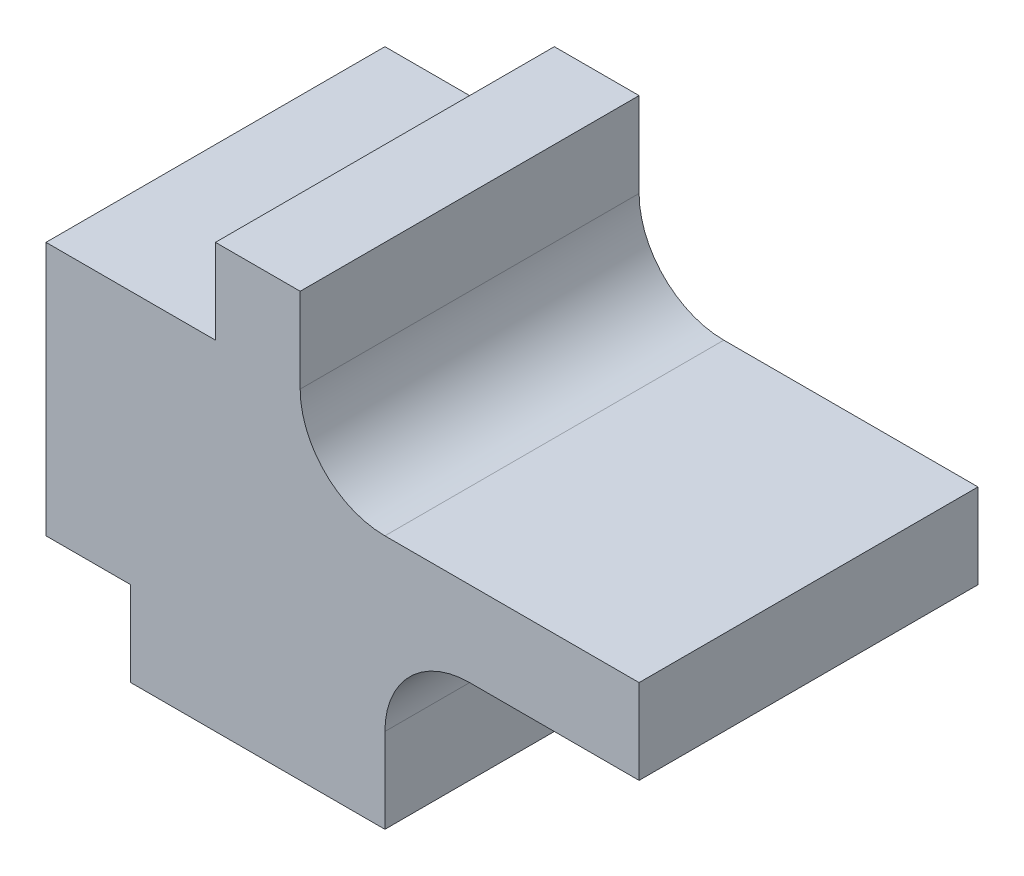
ISO-10303-21;
HEADER;
FILE_DESCRIPTION(('STEP AP214'),'2;1');
FILE_NAME('part.step','',(''),(''),'','','');
FILE_SCHEMA(('AUTOMOTIVE_DESIGN { 1 0 10303 214 1 1 1 1 }'));
ENDSEC;
DATA;
#1=APPLICATION_CONTEXT('core data for automotive mechanical design processes');
#2=APPLICATION_PROTOCOL_DEFINITION('international standard','automotive_design',2000,#1);
#3=PRODUCT_CONTEXT('',#1,'mechanical');
#4=PRODUCT('Part','Part','',(#3));
#5=PRODUCT_RELATED_PRODUCT_CATEGORY('part','',(#4));
#6=PRODUCT_DEFINITION_FORMATION('','',#4);
#7=PRODUCT_DEFINITION_CONTEXT('part definition',#1,'design');
#8=PRODUCT_DEFINITION('design','',#6,#7);
#9=PRODUCT_DEFINITION_SHAPE('','',#8);
#10=(LENGTH_UNIT() NAMED_UNIT(*) SI_UNIT(.MILLI.,.METRE.));
#11=(NAMED_UNIT(*) PLANE_ANGLE_UNIT() SI_UNIT($,.RADIAN.));
#12=(NAMED_UNIT(*) SI_UNIT($,.STERADIAN.) SOLID_ANGLE_UNIT());
#13=UNCERTAINTY_MEASURE_WITH_UNIT(LENGTH_MEASURE(1.E-05),#10,'distance_accuracy_value','');
#14=(GEOMETRIC_REPRESENTATION_CONTEXT(3) GLOBAL_UNCERTAINTY_ASSIGNED_CONTEXT((#13)) GLOBAL_UNIT_ASSIGNED_CONTEXT((#10,
#11,#12)) REPRESENTATION_CONTEXT('',''));
#15=CARTESIAN_POINT('',(0.,0.,0.));
#16=DIRECTION('',(0.,0.,1.));
#17=DIRECTION('',(1.,0.,0.));
#18=AXIS2_PLACEMENT_3D('',#15,#16,#17);
#19=CARTESIAN_POINT('',(0.,1.,4.));
#20=DIRECTION('',(1.,0.,0.));
#21=DIRECTION('',(0.,1.,0.));
#22=AXIS2_PLACEMENT_3D('',#19,#20,#21);
#23=PLANE('',#22);
#24=DIRECTION('',(0.,-1.,0.));
#25=VECTOR('',#24,1.);
#26=CARTESIAN_POINT('',(0.,1.,0.));
#27=LINE('',#26,#25);
#28=CARTESIAN_POINT('',(0.,1.,0.));
#29=VERTEX_POINT('',#28);
#30=CARTESIAN_POINT('',(0.,0.,0.));
#31=VERTEX_POINT('',#30);
#32=EDGE_CURVE('E165',#29,#31,#27,.T.);
#33=ORIENTED_EDGE('',*,*,#32,.T.);
#34=DIRECTION('',(0.,0.,-1.));
#35=VECTOR('',#34,1.);
#36=CARTESIAN_POINT('',(0.,0.,4.));
#37=LINE('',#36,#35);
#38=CARTESIAN_POINT('',(0.,0.,4.));
#39=VERTEX_POINT('',#38);
#40=EDGE_CURVE('E11',#39,#31,#37,.T.);
#41=ORIENTED_EDGE('',*,*,#40,.F.);
#42=DIRECTION('',(0.,-1.,0.));
#43=VECTOR('',#42,1.);
#44=CARTESIAN_POINT('',(0.,1.,4.));
#45=LINE('',#44,#43);
#46=CARTESIAN_POINT('',(0.,1.,4.));
#47=VERTEX_POINT('',#46);
#48=EDGE_CURVE('E191',#47,#39,#45,.T.);
#49=ORIENTED_EDGE('',*,*,#48,.F.);
#50=DIRECTION('',(0.,0.,-1.));
#51=VECTOR('',#50,1.);
#52=CARTESIAN_POINT('',(0.,1.,4.));
#53=LINE('',#52,#51);
#54=EDGE_CURVE('E161',#47,#29,#53,.T.);
#55=ORIENTED_EDGE('',*,*,#54,.T.);
#56=EDGE_LOOP('',(#33,#41,#49,#55));
#57=FACE_BOUND('',#56,.T.);
#58=ADVANCED_FACE('F33',(#57),#23,.F.);
#59=CARTESIAN_POINT('',(0.,0.,4.));
#60=DIRECTION('',(0.,1.,0.));
#61=DIRECTION('',(0.,0.,1.));
#62=AXIS2_PLACEMENT_3D('',#59,#60,#61);
#63=PLANE('',#62);
#64=DIRECTION('',(1.,0.,0.));
#65=VECTOR('',#64,1.);
#66=CARTESIAN_POINT('',(0.,0.,0.));
#67=LINE('',#66,#65);
#68=CARTESIAN_POINT('',(3.,0.,0.));
#69=VERTEX_POINT('',#68);
#70=EDGE_CURVE('E168',#31,#69,#67,.T.);
#71=ORIENTED_EDGE('',*,*,#70,.T.);
#72=DIRECTION('',(0.,0.,-1.));
#73=VECTOR('',#72,1.);
#74=CARTESIAN_POINT('',(3.,0.,4.));
#75=LINE('',#74,#73);
#76=CARTESIAN_POINT('',(3.,0.,4.));
#77=VERTEX_POINT('',#76);
#78=EDGE_CURVE('E41',#77,#69,#75,.T.);
#79=ORIENTED_EDGE('',*,*,#78,.F.);
#80=DIRECTION('',(1.,0.,0.));
#81=VECTOR('',#80,1.);
#82=CARTESIAN_POINT('',(0.,0.,4.));
#83=LINE('',#82,#81);
#84=EDGE_CURVE('E110',#39,#77,#83,.T.);
#85=ORIENTED_EDGE('',*,*,#84,.F.);
#86=ORIENTED_EDGE('',*,*,#40,.T.);
#87=EDGE_LOOP('',(#71,#79,#85,#86));
#88=FACE_BOUND('',#87,.T.);
#89=ADVANCED_FACE('F279',(#88),#63,.F.);
#90=CARTESIAN_POINT('',(3.,0.,4.));
#91=DIRECTION('',(-1.,0.,0.));
#92=DIRECTION('',(0.,-1.,0.));
#93=AXIS2_PLACEMENT_3D('',#90,#91,#92);
#94=PLANE('',#93);
#95=DIRECTION('',(0.,1.,0.));
#96=VECTOR('',#95,1.);
#97=CARTESIAN_POINT('',(3.,0.,0.));
#98=LINE('',#97,#96);
#99=CARTESIAN_POINT('',(3.,1.,0.));
#100=VERTEX_POINT('',#99);
#101=EDGE_CURVE('E170',#69,#100,#98,.T.);
#102=ORIENTED_EDGE('',*,*,#101,.T.);
#103=DIRECTION('',(0.,0.,-1.));
#104=VECTOR('',#103,1.);
#105=CARTESIAN_POINT('',(3.,1.,4.));
#106=LINE('',#105,#104);
#107=CARTESIAN_POINT('',(3.,1.,4.));
#108=VERTEX_POINT('',#107);
#109=EDGE_CURVE('E216',#108,#100,#106,.T.);
#110=ORIENTED_EDGE('',*,*,#109,.F.);
#111=DIRECTION('',(0.,1.,0.));
#112=VECTOR('',#111,1.);
#113=CARTESIAN_POINT('',(3.,0.,4.));
#114=LINE('',#113,#112);
#115=EDGE_CURVE('E224',#77,#108,#114,.T.);
#116=ORIENTED_EDGE('',*,*,#115,.F.);
#117=ORIENTED_EDGE('',*,*,#78,.T.);
#118=EDGE_LOOP('',(#102,#110,#116,#117));
#119=FACE_BOUND('',#118,.T.);
#120=ADVANCED_FACE('F222',(#119),#94,.F.);
#121=CARTESIAN_POINT('',(4.,1.,4.));
#122=DIRECTION('',(0.,0.,-1.));
#123=DIRECTION('',(-1.,0.,0.));
#124=AXIS2_PLACEMENT_3D('',#121,#122,#123);
#125=CYLINDRICAL_SURFACE('',#124,1.);
#126=CARTESIAN_POINT('',(4.,1.,0.));
#127=DIRECTION('',(0.,0.,-1.));
#128=DIRECTION('',(-1.,0.,0.));
#129=AXIS2_PLACEMENT_3D('',#126,#127,#128);
#130=CIRCLE('',#129,1.);
#131=CARTESIAN_POINT('',(4.,2.,0.));
#132=VERTEX_POINT('',#131);
#133=EDGE_CURVE('E172',#100,#132,#130,.T.);
#134=ORIENTED_EDGE('',*,*,#133,.T.);
#135=DIRECTION('',(0.,0.,-1.));
#136=VECTOR('',#135,1.);
#137=CARTESIAN_POINT('',(4.,2.,4.));
#138=LINE('',#137,#136);
#139=CARTESIAN_POINT('',(4.,2.,4.));
#140=VERTEX_POINT('',#139);
#141=EDGE_CURVE('E213',#140,#132,#138,.T.);
#142=ORIENTED_EDGE('',*,*,#141,.F.);
#143=CARTESIAN_POINT('',(4.,1.,4.));
#144=DIRECTION('',(0.,0.,-1.));
#145=DIRECTION('',(-1.,0.,0.));
#146=AXIS2_PLACEMENT_3D('',#143,#144,#145);
#147=CIRCLE('',#146,1.);
#148=EDGE_CURVE('E242',#108,#140,#147,.T.);
#149=ORIENTED_EDGE('',*,*,#148,.F.);
#150=ORIENTED_EDGE('',*,*,#109,.T.);
#151=EDGE_LOOP('',(#134,#142,#149,#150));
#152=FACE_BOUND('',#151,.T.);
#153=ADVANCED_FACE('F233',(#152),#125,.F.);
#154=CARTESIAN_POINT('',(4.,2.,4.));
#155=DIRECTION('',(0.,1.,0.));
#156=DIRECTION('',(-1.,0.,0.));
#157=AXIS2_PLACEMENT_3D('',#154,#155,#156);
#158=PLANE('',#157);
#159=DIRECTION('',(1.,0.,0.));
#160=VECTOR('',#159,1.);
#161=CARTESIAN_POINT('',(4.,2.,0.));
#162=LINE('',#161,#160);
#163=CARTESIAN_POINT('',(6.,2.,0.));
#164=VERTEX_POINT('',#163);
#165=EDGE_CURVE('E174',#132,#164,#162,.T.);
#166=ORIENTED_EDGE('',*,*,#165,.T.);
#167=DIRECTION('',(0.,0.,-1.));
#168=VECTOR('',#167,1.);
#169=CARTESIAN_POINT('',(6.,2.,4.));
#170=LINE('',#169,#168);
#171=CARTESIAN_POINT('',(6.,2.,4.));
#172=VERTEX_POINT('',#171);
#173=EDGE_CURVE('E210',#172,#164,#170,.T.);
#174=ORIENTED_EDGE('',*,*,#173,.F.);
#175=DIRECTION('',(1.,0.,0.));
#176=VECTOR('',#175,1.);
#177=CARTESIAN_POINT('',(4.,2.,4.));
#178=LINE('',#177,#176);
#179=EDGE_CURVE('E239',#140,#172,#178,.T.);
#180=ORIENTED_EDGE('',*,*,#179,.F.);
#181=ORIENTED_EDGE('',*,*,#141,.T.);
#182=EDGE_LOOP('',(#166,#174,#180,#181));
#183=FACE_BOUND('',#182,.T.);
#184=ADVANCED_FACE('F237',(#183),#158,.F.);
#185=CARTESIAN_POINT('',(6.,2.,4.));
#186=DIRECTION('',(-1.,0.,0.));
#187=DIRECTION('',(0.,0.,1.));
#188=AXIS2_PLACEMENT_3D('',#185,#186,#187);
#189=PLANE('',#188);
#190=DIRECTION('',(0.,1.,0.));
#191=VECTOR('',#190,1.);
#192=CARTESIAN_POINT('',(6.,2.,0.));
#193=LINE('',#192,#191);
#194=CARTESIAN_POINT('',(6.,3.,0.));
#195=VERTEX_POINT('',#194);
#196=EDGE_CURVE('E176',#164,#195,#193,.T.);
#197=ORIENTED_EDGE('',*,*,#196,.T.);
#198=DIRECTION('',(0.,0.,-1.));
#199=VECTOR('',#198,1.);
#200=CARTESIAN_POINT('',(6.,3.,4.));
#201=LINE('',#200,#199);
#202=CARTESIAN_POINT('',(6.,3.,4.));
#203=VERTEX_POINT('',#202);
#204=EDGE_CURVE('E207',#203,#195,#201,.T.);
#205=ORIENTED_EDGE('',*,*,#204,.F.);
#206=DIRECTION('',(0.,1.,0.));
#207=VECTOR('',#206,1.);
#208=CARTESIAN_POINT('',(6.,2.,4.));
#209=LINE('',#208,#207);
#210=EDGE_CURVE('E241',#172,#203,#209,.T.);
#211=ORIENTED_EDGE('',*,*,#210,.F.);
#212=ORIENTED_EDGE('',*,*,#173,.T.);
#213=EDGE_LOOP('',(#197,#205,#211,#212));
#214=FACE_BOUND('',#213,.T.);
#215=ADVANCED_FACE('F292',(#214),#189,.F.);
#216=CARTESIAN_POINT('',(6.,3.,4.));
#217=DIRECTION('',(0.,-1.,0.));
#218=DIRECTION('',(1.,0.,0.));
#219=AXIS2_PLACEMENT_3D('',#216,#217,#218);
#220=PLANE('',#219);
#221=DIRECTION('',(-1.,0.,0.));
#222=VECTOR('',#221,1.);
#223=CARTESIAN_POINT('',(6.,3.,0.));
#224=LINE('',#223,#222);
#225=CARTESIAN_POINT('',(3.,3.,0.));
#226=VERTEX_POINT('',#225);
#227=EDGE_CURVE('E178',#195,#226,#224,.T.);
#228=ORIENTED_EDGE('',*,*,#227,.T.);
#229=DIRECTION('',(0.,0.,-1.));
#230=VECTOR('',#229,1.);
#231=CARTESIAN_POINT('',(3.,3.,4.));
#232=LINE('',#231,#230);
#233=CARTESIAN_POINT('',(3.,3.,4.));
#234=VERTEX_POINT('',#233);
#235=EDGE_CURVE('E204',#234,#226,#232,.T.);
#236=ORIENTED_EDGE('',*,*,#235,.F.);
#237=DIRECTION('',(-1.,0.,0.));
#238=VECTOR('',#237,1.);
#239=CARTESIAN_POINT('',(6.,3.,4.));
#240=LINE('',#239,#238);
#241=EDGE_CURVE('E244',#203,#234,#240,.T.);
#242=ORIENTED_EDGE('',*,*,#241,.F.);
#243=ORIENTED_EDGE('',*,*,#204,.T.);
#244=EDGE_LOOP('',(#228,#236,#242,#243));
#245=FACE_BOUND('',#244,.T.);
#246=ADVANCED_FACE('F295',(#245),#220,.F.);
#247=CARTESIAN_POINT('',(3.,4.,4.));
#248=DIRECTION('',(0.,0.,-1.));
#249=DIRECTION('',(-1.,0.,0.));
#250=AXIS2_PLACEMENT_3D('',#247,#248,#249);
#251=CYLINDRICAL_SURFACE('',#250,0.999999999999999);
#252=CARTESIAN_POINT('',(3.,4.,0.));
#253=DIRECTION('',(0.,0.,-1.));
#254=DIRECTION('',(-1.,0.,0.));
#255=AXIS2_PLACEMENT_3D('',#252,#253,#254);
#256=CIRCLE('',#255,0.999999999999999);
#257=CARTESIAN_POINT('',(2.,4.,0.));
#258=VERTEX_POINT('',#257);
#259=EDGE_CURVE('E180',#226,#258,#256,.T.);
#260=ORIENTED_EDGE('',*,*,#259,.T.);
#261=DIRECTION('',(0.,0.,-1.));
#262=VECTOR('',#261,1.);
#263=CARTESIAN_POINT('',(2.,4.,4.));
#264=LINE('',#263,#262);
#265=CARTESIAN_POINT('',(2.,4.,4.));
#266=VERTEX_POINT('',#265);
#267=EDGE_CURVE('E201',#266,#258,#264,.T.);
#268=ORIENTED_EDGE('',*,*,#267,.F.);
#269=CARTESIAN_POINT('',(3.,4.,4.));
#270=DIRECTION('',(0.,0.,-1.));
#271=DIRECTION('',(-1.,0.,0.));
#272=AXIS2_PLACEMENT_3D('',#269,#270,#271);
#273=CIRCLE('',#272,0.999999999999999);
#274=EDGE_CURVE('E250',#234,#266,#273,.T.);
#275=ORIENTED_EDGE('',*,*,#274,.F.);
#276=ORIENTED_EDGE('',*,*,#235,.T.);
#277=EDGE_LOOP('',(#260,#268,#275,#276));
#278=FACE_BOUND('',#277,.T.);
#279=ADVANCED_FACE('F299',(#278),#251,.F.);
#280=CARTESIAN_POINT('',(2.,4.,4.));
#281=DIRECTION('',(-1.,0.,0.));
#282=DIRECTION('',(0.,-1.,0.));
#283=AXIS2_PLACEMENT_3D('',#280,#281,#282);
#284=PLANE('',#283);
#285=DIRECTION('',(0.,1.,0.));
#286=VECTOR('',#285,1.);
#287=CARTESIAN_POINT('',(2.,4.,0.));
#288=LINE('',#287,#286);
#289=CARTESIAN_POINT('',(2.,5.,0.));
#290=VERTEX_POINT('',#289);
#291=EDGE_CURVE('E182',#258,#290,#288,.T.);
#292=ORIENTED_EDGE('',*,*,#291,.T.);
#293=DIRECTION('',(0.,0.,-1.));
#294=VECTOR('',#293,1.);
#295=CARTESIAN_POINT('',(2.,5.,4.));
#296=LINE('',#295,#294);
#297=CARTESIAN_POINT('',(2.,5.,4.));
#298=VERTEX_POINT('',#297);
#299=EDGE_CURVE('E198',#298,#290,#296,.T.);
#300=ORIENTED_EDGE('',*,*,#299,.F.);
#301=DIRECTION('',(0.,1.,0.));
#302=VECTOR('',#301,1.);
#303=CARTESIAN_POINT('',(2.,4.,4.));
#304=LINE('',#303,#302);
#305=EDGE_CURVE('E252',#266,#298,#304,.T.);
#306=ORIENTED_EDGE('',*,*,#305,.F.);
#307=ORIENTED_EDGE('',*,*,#267,.T.);
#308=EDGE_LOOP('',(#292,#300,#306,#307));
#309=FACE_BOUND('',#308,.T.);
#310=ADVANCED_FACE('F303',(#309),#284,.F.);
#311=CARTESIAN_POINT('',(2.,5.,4.));
#312=DIRECTION('',(0.,-1.,0.));
#313=DIRECTION('',(0.,0.,-1.));
#314=AXIS2_PLACEMENT_3D('',#311,#312,#313);
#315=PLANE('',#314);
#316=DIRECTION('',(-1.,0.,0.));
#317=VECTOR('',#316,1.);
#318=CARTESIAN_POINT('',(2.,5.,0.));
#319=LINE('',#318,#317);
#320=CARTESIAN_POINT('',(0.999999999999997,5.,0.));
#321=VERTEX_POINT('',#320);
#322=EDGE_CURVE('E184',#290,#321,#319,.T.);
#323=ORIENTED_EDGE('',*,*,#322,.T.);
#324=DIRECTION('',(0.,0.,-1.));
#325=VECTOR('',#324,1.);
#326=CARTESIAN_POINT('',(0.999999999999997,5.,4.));
#327=LINE('',#326,#325);
#328=CARTESIAN_POINT('',(0.999999999999997,5.,4.));
#329=VERTEX_POINT('',#328);
#330=EDGE_CURVE('E195',#329,#321,#327,.T.);
#331=ORIENTED_EDGE('',*,*,#330,.F.);
#332=DIRECTION('',(-1.,0.,0.));
#333=VECTOR('',#332,1.);
#334=CARTESIAN_POINT('',(2.,5.,4.));
#335=LINE('',#334,#333);
#336=EDGE_CURVE('E254',#298,#329,#335,.T.);
#337=ORIENTED_EDGE('',*,*,#336,.F.);
#338=ORIENTED_EDGE('',*,*,#299,.T.);
#339=EDGE_LOOP('',(#323,#331,#337,#338));
#340=FACE_BOUND('',#339,.T.);
#341=ADVANCED_FACE('F260',(#340),#315,.F.);
#342=CARTESIAN_POINT('',(0.999999999999997,5.,4.));
#343=DIRECTION('',(1.,0.,0.));
#344=DIRECTION('',(0.,0.,-1.));
#345=AXIS2_PLACEMENT_3D('',#342,#343,#344);
#346=PLANE('',#345);
#347=DIRECTION('',(0.,-1.,0.));
#348=VECTOR('',#347,1.);
#349=CARTESIAN_POINT('',(0.999999999999997,5.,0.));
#350=LINE('',#349,#348);
#351=CARTESIAN_POINT('',(0.999999999999997,4.,0.));
#352=VERTEX_POINT('',#351);
#353=EDGE_CURVE('E186',#321,#352,#350,.T.);
#354=ORIENTED_EDGE('',*,*,#353,.T.);
#355=DIRECTION('',(0.,0.,-1.));
#356=VECTOR('',#355,1.);
#357=CARTESIAN_POINT('',(0.999999999999997,4.,4.));
#358=LINE('',#357,#356);
#359=CARTESIAN_POINT('',(0.999999999999997,4.,4.));
#360=VERTEX_POINT('',#359);
#361=EDGE_CURVE('E156',#360,#352,#358,.T.);
#362=ORIENTED_EDGE('',*,*,#361,.F.);
#363=DIRECTION('',(0.,-1.,0.));
#364=VECTOR('',#363,1.);
#365=CARTESIAN_POINT('',(0.999999999999997,5.,4.));
#366=LINE('',#365,#364);
#367=EDGE_CURVE('E147',#329,#360,#366,.T.);
#368=ORIENTED_EDGE('',*,*,#367,.F.);
#369=ORIENTED_EDGE('',*,*,#330,.T.);
#370=EDGE_LOOP('',(#354,#362,#368,#369));
#371=FACE_BOUND('',#370,.T.);
#372=ADVANCED_FACE('F264',(#371),#346,.F.);
#373=CARTESIAN_POINT('',(0.999999999999997,4.,4.));
#374=DIRECTION('',(0.,-1.,0.));
#375=DIRECTION('',(0.,0.,-1.));
#376=AXIS2_PLACEMENT_3D('',#373,#374,#375);
#377=PLANE('',#376);
#378=DIRECTION('',(-1.,0.,0.));
#379=VECTOR('',#378,1.);
#380=CARTESIAN_POINT('',(0.999999999999997,4.,0.));
#381=LINE('',#380,#379);
#382=CARTESIAN_POINT('',(-0.999999999999999,4.,0.));
#383=VERTEX_POINT('',#382);
#384=EDGE_CURVE('E155',#352,#383,#381,.T.);
#385=ORIENTED_EDGE('',*,*,#384,.T.);
#386=DIRECTION('',(0.,0.,-1.));
#387=VECTOR('',#386,1.);
#388=CARTESIAN_POINT('',(-0.999999999999999,4.,4.));
#389=LINE('',#388,#387);
#390=CARTESIAN_POINT('',(-0.999999999999999,4.,4.));
#391=VERTEX_POINT('',#390);
#392=EDGE_CURVE('E152',#391,#383,#389,.T.);
#393=ORIENTED_EDGE('',*,*,#392,.F.);
#394=DIRECTION('',(-1.,0.,0.));
#395=VECTOR('',#394,1.);
#396=CARTESIAN_POINT('',(0.999999999999997,4.,4.));
#397=LINE('',#396,#395);
#398=EDGE_CURVE('E141',#360,#391,#397,.T.);
#399=ORIENTED_EDGE('',*,*,#398,.F.);
#400=ORIENTED_EDGE('',*,*,#361,.T.);
#401=EDGE_LOOP('',(#385,#393,#399,#400));
#402=FACE_BOUND('',#401,.T.);
#403=ADVANCED_FACE('F153',(#402),#377,.F.);
#404=CARTESIAN_POINT('',(-0.999999999999999,4.,4.));
#405=DIRECTION('',(1.,0.,0.));
#406=DIRECTION('',(0.,0.,-1.));
#407=AXIS2_PLACEMENT_3D('',#404,#405,#406);
#408=PLANE('',#407);
#409=DIRECTION('',(0.,-1.,0.));
#410=VECTOR('',#409,1.);
#411=CARTESIAN_POINT('',(-0.999999999999999,4.,0.));
#412=LINE('',#411,#410);
#413=CARTESIAN_POINT('',(-0.999999999999999,1.,0.));
#414=VERTEX_POINT('',#413);
#415=EDGE_CURVE('E96',#383,#414,#412,.T.);
#416=ORIENTED_EDGE('',*,*,#415,.T.);
#417=DIRECTION('',(0.,0.,-1.));
#418=VECTOR('',#417,1.);
#419=CARTESIAN_POINT('',(-0.999999999999999,1.,4.));
#420=LINE('',#419,#418);
#421=CARTESIAN_POINT('',(-0.999999999999999,1.,4.));
#422=VERTEX_POINT('',#421);
#423=EDGE_CURVE('E157',#422,#414,#420,.T.);
#424=ORIENTED_EDGE('',*,*,#423,.F.);
#425=DIRECTION('',(0.,-1.,0.));
#426=VECTOR('',#425,1.);
#427=CARTESIAN_POINT('',(-0.999999999999999,4.,4.));
#428=LINE('',#427,#426);
#429=EDGE_CURVE('E145',#391,#422,#428,.T.);
#430=ORIENTED_EDGE('',*,*,#429,.F.);
#431=ORIENTED_EDGE('',*,*,#392,.T.);
#432=EDGE_LOOP('',(#416,#424,#430,#431));
#433=FACE_BOUND('',#432,.T.);
#434=ADVANCED_FACE('F159',(#433),#408,.F.);
#435=CARTESIAN_POINT('',(-0.999999999999999,1.,4.));
#436=DIRECTION('',(0.,1.,0.));
#437=DIRECTION('',(0.,0.,1.));
#438=AXIS2_PLACEMENT_3D('',#435,#436,#437);
#439=PLANE('',#438);
#440=DIRECTION('',(1.,0.,0.));
#441=VECTOR('',#440,1.);
#442=CARTESIAN_POINT('',(-0.999999999999999,1.,0.));
#443=LINE('',#442,#441);
#444=EDGE_CURVE('E102',#414,#29,#443,.T.);
#445=ORIENTED_EDGE('',*,*,#444,.T.);
#446=ORIENTED_EDGE('',*,*,#54,.F.);
#447=DIRECTION('',(1.,0.,0.));
#448=VECTOR('',#447,1.);
#449=CARTESIAN_POINT('',(-0.999999999999999,1.,4.));
#450=LINE('',#449,#448);
#451=EDGE_CURVE('E49',#422,#47,#450,.T.);
#452=ORIENTED_EDGE('',*,*,#451,.F.);
#453=ORIENTED_EDGE('',*,*,#423,.T.);
#454=EDGE_LOOP('',(#445,#446,#452,#453));
#455=FACE_BOUND('',#454,.T.);
#456=ADVANCED_FACE('F268',(#455),#439,.F.);
#457=CARTESIAN_POINT('',(4.,1.,4.));
#458=DIRECTION('',(0.,0.,-1.));
#459=DIRECTION('',(-1.,0.,0.));
#460=AXIS2_PLACEMENT_3D('',#457,#458,#459);
#461=PLANE('',#460);
#462=ORIENTED_EDGE('',*,*,#48,.T.);
#463=ORIENTED_EDGE('',*,*,#84,.T.);
#464=ORIENTED_EDGE('',*,*,#115,.T.);
#465=ORIENTED_EDGE('',*,*,#148,.T.);
#466=ORIENTED_EDGE('',*,*,#179,.T.);
#467=ORIENTED_EDGE('',*,*,#210,.T.);
#468=ORIENTED_EDGE('',*,*,#241,.T.);
#469=ORIENTED_EDGE('',*,*,#274,.T.);
#470=ORIENTED_EDGE('',*,*,#305,.T.);
#471=ORIENTED_EDGE('',*,*,#336,.T.);
#472=ORIENTED_EDGE('',*,*,#367,.T.);
#473=ORIENTED_EDGE('',*,*,#398,.T.);
#474=ORIENTED_EDGE('',*,*,#429,.T.);
#475=ORIENTED_EDGE('',*,*,#451,.T.);
#476=EDGE_LOOP('',(#462,#463,#464,#465,#466,#467,#468,#469,#470,#471,#472,#473,#474,#475));
#477=FACE_BOUND('',#476,.T.);
#478=ADVANCED_FACE('F143',(#477),#461,.F.);
#479=CARTESIAN_POINT('',(4.,1.,0.));
#480=DIRECTION('',(0.,0.,-1.));
#481=DIRECTION('',(-1.,0.,0.));
#482=AXIS2_PLACEMENT_3D('',#479,#480,#481);
#483=PLANE('',#482);
#484=ORIENTED_EDGE('',*,*,#32,.F.);
#485=ORIENTED_EDGE('',*,*,#444,.F.);
#486=ORIENTED_EDGE('',*,*,#415,.F.);
#487=ORIENTED_EDGE('',*,*,#384,.F.);
#488=ORIENTED_EDGE('',*,*,#353,.F.);
#489=ORIENTED_EDGE('',*,*,#322,.F.);
#490=ORIENTED_EDGE('',*,*,#291,.F.);
#491=ORIENTED_EDGE('',*,*,#259,.F.);
#492=ORIENTED_EDGE('',*,*,#227,.F.);
#493=ORIENTED_EDGE('',*,*,#196,.F.);
#494=ORIENTED_EDGE('',*,*,#165,.F.);
#495=ORIENTED_EDGE('',*,*,#133,.F.);
#496=ORIENTED_EDGE('',*,*,#101,.F.);
#497=ORIENTED_EDGE('',*,*,#70,.F.);
#498=EDGE_LOOP('',(#484,#485,#486,#487,#488,#489,#490,#491,#492,#493,#494,#495,#496,#497));
#499=FACE_BOUND('',#498,.T.);
#500=ADVANCED_FACE('F228',(#499),#483,.T.);
#501=CLOSED_SHELL('',(#58,#89,#120,#153,#184,#215,#246,#279,#310,#341,#372,#403,#434,#456,#478,#500));
#502=MANIFOLD_SOLID_BREP('B2',#501);
#503=ADVANCED_BREP_SHAPE_REPRESENTATION('',(#18,#502),#14);
#504=SHAPE_DEFINITION_REPRESENTATION(#9,#503);
ENDSEC;
END-ISO-10303-21;
